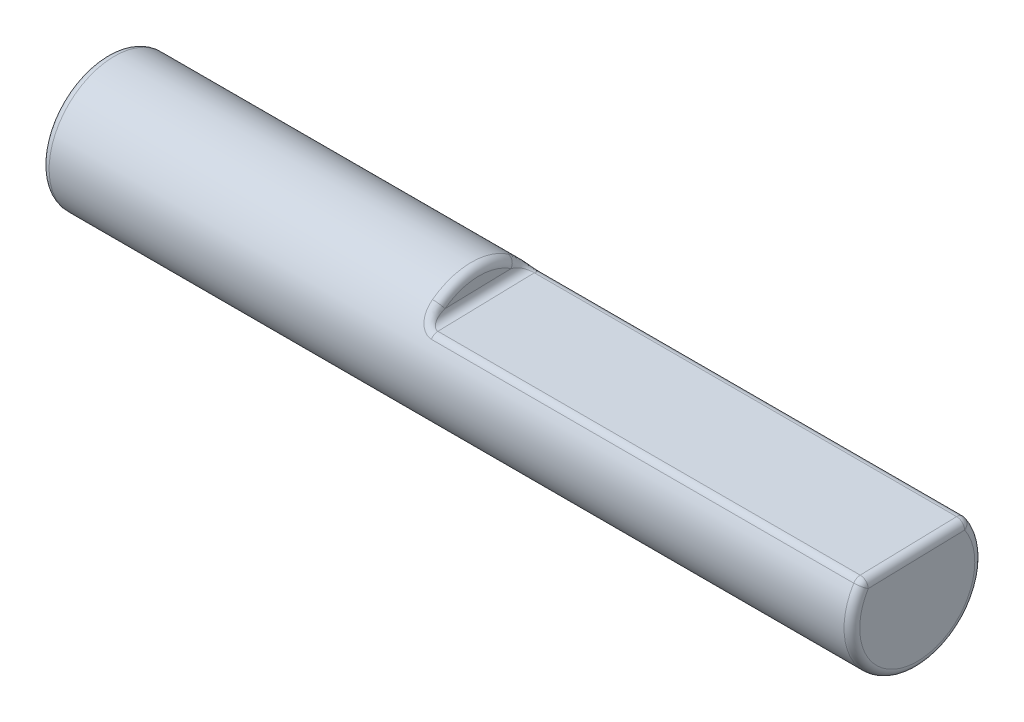
ISO-10303-21;
HEADER;
FILE_DESCRIPTION(('STEP AP214'),'2;1');
FILE_NAME('part.step','',(''),(''),'','','');
FILE_SCHEMA(('AUTOMOTIVE_DESIGN { 1 0 10303 214 1 1 1 1 }'));
ENDSEC;
DATA;
#1=APPLICATION_CONTEXT('core data for automotive mechanical design processes');
#2=APPLICATION_PROTOCOL_DEFINITION('international standard','automotive_design',2000,#1);
#3=PRODUCT_CONTEXT('',#1,'mechanical');
#4=PRODUCT('Part','Part','',(#3));
#5=PRODUCT_RELATED_PRODUCT_CATEGORY('part','',(#4));
#6=PRODUCT_DEFINITION_FORMATION('','',#4);
#7=PRODUCT_DEFINITION_CONTEXT('part definition',#1,'design');
#8=PRODUCT_DEFINITION('design','',#6,#7);
#9=PRODUCT_DEFINITION_SHAPE('','',#8);
#10=(LENGTH_UNIT() NAMED_UNIT(*) SI_UNIT(.MILLI.,.METRE.));
#11=(NAMED_UNIT(*) PLANE_ANGLE_UNIT() SI_UNIT($,.RADIAN.));
#12=(NAMED_UNIT(*) SI_UNIT($,.STERADIAN.) SOLID_ANGLE_UNIT());
#13=UNCERTAINTY_MEASURE_WITH_UNIT(LENGTH_MEASURE(1.E-05),#10,'distance_accuracy_value','');
#14=(GEOMETRIC_REPRESENTATION_CONTEXT(3) GLOBAL_UNCERTAINTY_ASSIGNED_CONTEXT((#13)) GLOBAL_UNIT_ASSIGNED_CONTEXT((#10,
#11,#12)) REPRESENTATION_CONTEXT('',''));
#15=CARTESIAN_POINT('',(0.,0.,0.));
#16=DIRECTION('',(0.,0.,1.));
#17=DIRECTION('',(1.,0.,0.));
#18=AXIS2_PLACEMENT_3D('',#15,#16,#17);
#19=CARTESIAN_POINT('',(39.37,0.,0.));
#20=DIRECTION('',(-1.,0.,0.));
#21=DIRECTION('',(0.,0.,1.));
#22=AXIS2_PLACEMENT_3D('',#19,#20,#21);
#23=CYLINDRICAL_SURFACE('',#22,3.175);
#24=CARTESIAN_POINT('',(0.380999999999999,0.,0.));
#25=DIRECTION('',(1.,0.,0.));
#26=DIRECTION('',(0.,0.,-1.));
#27=AXIS2_PLACEMENT_3D('',#24,#25,#26);
#28=CIRCLE('',#27,3.175);
#29=CARTESIAN_POINT('',(0.380999999999999,0.,-3.175));
#30=VERTEX_POINT('',#29);
#31=EDGE_CURVE('E297',#30,#30,#28,.T.);
#32=ORIENTED_EDGE('',*,*,#31,.T.);
#33=EDGE_LOOP('',(#32));
#34=FACE_BOUND('',#33,.T.);
#35=CARTESIAN_POINT('',(18.5864113464813,1.86061677622849,2.36945052063749));
#36=CARTESIAN_POINT('',(18.6239620396878,1.8664609920511,2.57606934951021));
#37=CARTESIAN_POINT('',(18.6943226929627,1.69924548178732,2.68201226556207));
#38=CARTESIAN_POINT('',(18.5691276856336,1.85531270441578,2.37616676666429));
#39=CARTESIAN_POINT('',(18.600875282423,1.85749105612046,2.58277024156461));
#40=CARTESIAN_POINT('',(18.6597553712666,1.68738842412367,2.68949626337339));
#41=CARTESIAN_POINT('',(18.5513109242381,1.85128223441124,2.38121692365727));
#42=CARTESIAN_POINT('',(18.5768882237581,1.85068500253967,2.58781753681003));
#43=CARTESIAN_POINT('',(18.6241218484758,1.67837691595813,2.69512250049785));
#44=CARTESIAN_POINT('',(18.5151628451154,1.84587687221378,2.38795387459997));
#45=CARTESIAN_POINT('',(18.5281157818434,1.84157359403442,2.59454953766819));
#46=CARTESIAN_POINT('',(18.551825690231,1.66629032446794,2.70262711959848));
#47=CARTESIAN_POINT('',(18.4968321068419,1.84449910257518,2.38964431297881));
#48=CARTESIAN_POINT('',(18.5033012442463,1.83925197265389,2.59624634845099));
#49=CARTESIAN_POINT('',(18.5151642136843,1.66320880874467,2.70450956262816));
#50=CARTESIAN_POINT('',(18.4599786529568,1.84449552930852,2.38964534121022));
#51=CARTESIAN_POINT('',(18.4534427111945,1.83924541956583,2.59624879138466));
#52=CARTESIAN_POINT('',(18.441457305913,1.66320071994776,2.70451062871122));
#53=CARTESIAN_POINT('',(18.4414559089441,1.84589828072248,2.3879208611442));
#54=CARTESIAN_POINT('',(18.4283680865988,1.84160861468443,2.59451922324205));
#55=CARTESIAN_POINT('',(18.4044118178863,1.66633801200165,2.70259019769311));
#56=CARTESIAN_POINT('',(18.4049745013587,1.85142600111972,2.38104446763984));
#57=CARTESIAN_POINT('',(18.3791486169153,1.85092869396238,2.58764220598247));
#58=CARTESIAN_POINT('',(18.3314490027194,1.67869857779526,2.69493054907568));
#59=CARTESIAN_POINT('',(18.3870156565798,1.8555500860408,2.37589366728384));
#60=CARTESIAN_POINT('',(18.3549728002052,1.85789594340085,2.5824870818938));
#61=CARTESIAN_POINT('',(18.2955313131668,1.68791987506304,2.68919257165323));
#62=CARTESIAN_POINT('',(18.3522078075911,1.86628287038285,2.36224541373698));
#63=CARTESIAN_POINT('',(18.3084290954819,1.87606450098342,2.56887370326151));
#64=CARTESIAN_POINT('',(18.225915615175,1.71191094840253,2.67398282988706));
#65=CARTESIAN_POINT('',(18.3353561737102,1.87288541272295,2.35375625136794));
#66=CARTESIAN_POINT('',(18.2860283498056,1.8872793953742,2.56040524868403));
#67=CARTESIAN_POINT('',(18.1922123473936,1.72666697481243,2.66452031537807));
#68=CARTESIAN_POINT('',(18.3031058699795,1.88824233783816,2.33353659065094));
#69=CARTESIAN_POINT('',(18.2436400200386,1.91343730516876,2.54031499979632));
#70=CARTESIAN_POINT('',(18.1277117399579,1.76097448524634,2.641971655952));
#71=CARTESIAN_POINT('',(18.2877095857453,1.89700017172521,2.32180089007985));
#72=CARTESIAN_POINT('',(18.2236330136026,1.92842247979147,2.52865914842707));
#73=CARTESIAN_POINT('',(18.0969191715348,1.78053366009441,2.62887969517106));
#74=CARTESIAN_POINT('',(18.2582241196294,1.91655090994752,2.29484670019643));
#75=CARTESIAN_POINT('',(18.1860031415294,1.96198733713377,2.50200106090461));
#76=CARTESIAN_POINT('',(18.037948239213,1.82417519910743,2.59879421738565));
#77=CARTESIAN_POINT('',(18.2441938216674,1.92740079294856,2.27952725029035));
#78=CARTESIAN_POINT('',(18.1684667890501,1.98071569139524,2.48686134279981));
#79=CARTESIAN_POINT('',(18.0098876431477,1.84838410573956,2.58168754224174));
#80=CARTESIAN_POINT('',(18.21819636433,1.95044233090003,2.24590286258762));
#81=CARTESIAN_POINT('',(18.1369282094077,2.02063141439924,2.45378195785048));
#82=CARTESIAN_POINT('',(17.957892728466,1.89976428689574,2.54411811476548));
#83=CARTESIAN_POINT('',(18.20623157848,1.96263550345286,2.22759453657761));
#84=CARTESIAN_POINT('',(18.1229278039632,2.04188053771935,2.43578407032227));
#85=CARTESIAN_POINT('',(17.9339631569006,1.92693891165497,2.52365155349101));
#86=CARTESIAN_POINT('',(18.1802938803284,1.99264886394887,2.18088857820481));
#87=CARTESIAN_POINT('',(18.0939779101287,2.09447536878849,2.38998506591887));
#88=CARTESIAN_POINT('',(17.8820877607386,1.99378163171355,2.47140825448484));
#89=CARTESIAN_POINT('',(18.1672674359335,2.01085591234254,2.15129100670114));
#90=CARTESIAN_POINT('',(18.0807722093846,2.12660683697858,2.36102216723603));
#91=CARTESIAN_POINT('',(17.8560348718877,2.03429405335517,2.43827823086114));
#92=CARTESIAN_POINT('',(18.1449914781523,2.04782943375368,2.08793927786675));
#93=CARTESIAN_POINT('',(18.061155442702,2.19215653699959,2.29941171032207));
#94=CARTESIAN_POINT('',(17.8114829562839,2.11646998902106,2.36730788375926));
#95=CARTESIAN_POINT('',(18.1357463028738,2.06659652295876,2.05418040386822));
#96=CARTESIAN_POINT('',(18.0548419075053,2.22571762123843,2.26658152208577));
#97=CARTESIAN_POINT('',(17.7929926057465,2.1581347669446,2.32946221475157));
#98=CARTESIAN_POINT('',(18.1175767324406,2.11127559581752,1.96934888447875));
#99=CARTESIAN_POINT('',(18.0470916814408,2.30634325466988,2.18416014327292));
#100=CARTESIAN_POINT('',(17.7566534648827,2.25719798063517,2.23428957702657));
#101=CARTESIAN_POINT('',(18.1102131041597,2.13709014841927,1.91669422351018));
#102=CARTESIAN_POINT('',(18.0489088708258,2.3532876102863,2.13313926749371));
#103=CARTESIAN_POINT('',(17.7419262082862,2.31432941245921,2.17516089294884));
#104=CARTESIAN_POINT('',(18.1004629166156,2.18716484872636,1.8064000485531));
#105=CARTESIAN_POINT('',(18.0624453938521,2.4450308250721,2.0269072916934));
#106=CARTESIAN_POINT('',(17.7224258332648,2.42491686404692,2.05119042107964));
#107=CARTESIAN_POINT('',(18.0981063710277,2.21141478255827,1.7487326188638));
#108=CARTESIAN_POINT('',(18.0746512057677,2.4899364477066,1.97126510354333));
#109=CARTESIAN_POINT('',(17.7177127421912,2.47834887258038,1.98631659577111));
#110=CARTESIAN_POINT('',(18.0971997300512,2.25308918931056,1.64154501717416));
#111=CARTESIAN_POINT('',(18.1038065780548,2.5675813512571,1.86856339253274));
#112=CARTESIAN_POINT('',(17.7158994599932,2.56994052925046,1.86563624935163));
#113=CARTESIAN_POINT('',(18.0979940123679,2.27091978608572,1.59264377162258));
#114=CARTESIAN_POINT('',(18.1197093303457,2.60124831444892,1.82140194567038));
#115=CARTESIAN_POINT('',(17.7174880243634,2.60904074450167,1.8105452240383));
#116=CARTESIAN_POINT('',(18.1013892506501,2.3049894412546,1.49291444033796));
#117=CARTESIAN_POINT('',(18.1560085124755,2.66631382468721,1.72508979460888));
#118=CARTESIAN_POINT('',(17.7242785009295,2.68356961941778,1.69812625423316));
#119=CARTESIAN_POINT('',(18.1039925353414,2.32122641740139,1.44208395091788));
#120=CARTESIAN_POINT('',(18.1766200444994,2.69765457973562,1.67579499349747));
#121=CARTESIAN_POINT('',(17.7294850705777,2.718993478883,1.64079551644434));
#122=CARTESIAN_POINT('',(18.1104252595926,2.35173838787002,1.33979125008395));
#123=CARTESIAN_POINT('',(18.2211828364737,2.75740753118695,1.57615280226641));
#124=CARTESIAN_POINT('',(17.7423505192883,2.78536536104795,1.52535910882586));
#125=CARTESIAN_POINT('',(18.1142316771751,2.36604354938308,1.28835707996336));
#126=CARTESIAN_POINT('',(18.2452540223914,2.78579308492647,1.52569960894812));
#127=CARTESIAN_POINT('',(17.7499633544017,2.81638273242603,1.46728619497699));
#128=CARTESIAN_POINT('',(18.1226335397235,2.3929742143745,1.18429308388464));
#129=CARTESIAN_POINT('',(18.2963637336602,2.84029317299343,1.42251192748725));
#130=CARTESIAN_POINT('',(17.7667670793957,2.8745668069564,1.34973233304563));
#131=CARTESIAN_POINT('',(18.1272267183352,2.40560436247825,1.1316670589229));
#132=CARTESIAN_POINT('',(18.3235182991249,2.86629149250078,1.36970693172968));
#133=CARTESIAN_POINT('',(17.7759534365679,2.90174417233004,1.29025584106037));
#134=CARTESIAN_POINT('',(18.1320010351724,2.41740942277435,1.07845527244792));
#135=CARTESIAN_POINT('',(18.351042503335,2.89057483799125,1.31683559197641));
#136=CARTESIAN_POINT('',(17.7855020703449,2.92703004363375,1.2300894779102));
#137=(BOUNDED_SURFACE() B_SPLINE_SURFACE(3,2,((#35,#36,#37),(#38,#39,#40),(#41,#42,#43),(#44,
#45,#46),(#47,#48,#49),(#50,#51,#52),(#53,#54,#55),(#56,#57,#58),(#59,#60,#61),(#62,#63,#64),
(#65,#66,#67),(#68,#69,#70),(#71,#72,#73),(#74,#75,#76),(#77,#78,#79),(#80,#81,#82),(#83,#84,
#85),(#86,#87,#88),(#89,#90,#91),(#92,#93,#94),(#95,#96,#97),(#98,#99,#100),(#101,#102,#103),
(#104,#105,#106),(#107,#108,#109),(#110,#111,#112),(#113,#114,#115),(#116,#117,#118),(#119,#120,
#121),(#122,#123,#124),(#125,#126,#127),(#128,#129,#130),(#131,#132,#133),(#134,#135,#136)),
.UNSPECIFIED.,.F.,.F.,.F.) B_SPLINE_SURFACE_WITH_KNOTS((4,2,2,2,2,2,2,2,2,2,2,2,2,2,2,2,4),(3,
3),(0.,0.109979605014105,0.21983984523759,0.330834159910746,0.441792434311733,0.552476866686735,
0.663339696503121,0.777812327617676,0.89241563857201,1.05027319729736,1.2083113554563,
1.42859982924447,1.65020508343153,1.82836901100805,2.00676271461983,2.18193077376074,
2.35660247596006),(0.,1.),
.UNSPECIFIED.) GEOMETRIC_REPRESENTATION_ITEM() RATIONAL_B_SPLINE_SURFACE(((1.,0.875696525181188,
1.),(1.,0.876819204022842,1.),(1.,0.877647414738648,1.),(1.,0.878741401126171,1.),(1.,
0.87900778625312,1.),(1.,0.879006937081256,1.),(1.,0.878734165904822,1.),(1.,0.877621403045872,
1.),(1.,0.876781595570752,1.),(1.,0.874483221090066,1.),(1.,0.873026186281496,1.),(1.,
0.869421553804353,1.),(1.,0.867272846894885,1.),(1.,0.862141294560381,1.),(1.,0.859133566871117,
1.),(1.,0.852278123703959,1.),(1.,0.848429453231229,1.),(1.,0.838277208471232,1.),(1.,
0.831595334164918,1.),(1.,0.816756892948542,1.),(1.,0.808598647638927,1.),(1.,0.78754094815492,
1.),(1.,0.774039732630419,1.),(1.,0.745150665958186,1.),(1.,0.729752019803924,1.),(1.,
0.700926713202265,1.),(1.,0.68770522078148,1.),(1.,0.660816578297561,1.),(1.,0.647148875465999,
1.),(1.,0.619959656878177,1.),(1.,0.606439966404383,1.),(1.,0.579679073015142,1.),(1.,
0.566437189530011,1.),(1.,0.553482817324471,1.))) REPRESENTATION_ITEM('') SURFACE());
#138=CARTESIAN_POINT('',(17.7855020703449,2.92703004363375,1.2300894779102));
#139=CARTESIAN_POINT('',(17.7759534365679,2.90174417233004,1.29025584106037));
#140=CARTESIAN_POINT('',(17.7667670793957,2.8745668069564,1.34973233304563));
#141=CARTESIAN_POINT('',(17.7499633544017,2.81638273242603,1.46728619497699));
#142=CARTESIAN_POINT('',(17.7423505192883,2.78536536104795,1.52535910882586));
#143=CARTESIAN_POINT('',(17.7294850705777,2.718993478883,1.64079551644434));
#144=CARTESIAN_POINT('',(17.7242785009295,2.68356961941778,1.69812625423316));
#145=CARTESIAN_POINT('',(17.7174880243634,2.60904074450167,1.8105452240383));
#146=CARTESIAN_POINT('',(17.7158994599932,2.56994052925046,1.86563624935163));
#147=CARTESIAN_POINT('',(17.7177127421912,2.47834887258038,1.98631659577111));
#148=CARTESIAN_POINT('',(17.7224258332648,2.42491686404692,2.05119042107964));
#149=CARTESIAN_POINT('',(17.7419262082862,2.31432941245921,2.17516089294884));
#150=CARTESIAN_POINT('',(17.7566534648827,2.25719798063517,2.23428957702657));
#151=CARTESIAN_POINT('',(17.7929926057465,2.1581347669446,2.32946221475157));
#152=CARTESIAN_POINT('',(17.8114829562839,2.11646998902107,2.36730788375926));
#153=CARTESIAN_POINT('',(17.8560348718877,2.03429405335517,2.43827823086114));
#154=CARTESIAN_POINT('',(17.8820877607386,1.99378163171355,2.47140825448484));
#155=CARTESIAN_POINT('',(17.9339631569006,1.92693891165497,2.52365155349101));
#156=CARTESIAN_POINT('',(17.957892728466,1.89976428689574,2.54411811476548));
#157=CARTESIAN_POINT('',(18.0098876431477,1.84838410573956,2.58168754224174));
#158=CARTESIAN_POINT('',(18.037948239213,1.82417519910743,2.59879421738565));
#159=CARTESIAN_POINT('',(18.0969191715348,1.78053366009441,2.62887969517106));
#160=CARTESIAN_POINT('',(18.1277117399579,1.76097448524634,2.641971655952));
#161=CARTESIAN_POINT('',(18.1922123473936,1.72666697481243,2.66452031537807));
#162=CARTESIAN_POINT('',(18.225915615175,1.71191094840253,2.67398282988706));
#163=CARTESIAN_POINT('',(18.2955313131668,1.68791987506304,2.68919257165323));
#164=CARTESIAN_POINT('',(18.3314490027194,1.67869857779526,2.69493054907568));
#165=CARTESIAN_POINT('',(18.4044118178863,1.66633801200165,2.70259019769311));
#166=CARTESIAN_POINT('',(18.441457305913,1.66320071994777,2.70451062871122));
#167=CARTESIAN_POINT('',(18.5151642136843,1.66320880874467,2.70450956262816));
#168=CARTESIAN_POINT('',(18.551825690231,1.66629032446794,2.70262711959848));
#169=CARTESIAN_POINT('',(18.6241218484758,1.67837691595813,2.69512250049785));
#170=CARTESIAN_POINT('',(18.6597553712666,1.68738842412367,2.68949626337339));
#171=CARTESIAN_POINT('',(18.6943226929627,1.69924548178732,2.68201226556207));
#172=B_SPLINE_CURVE_WITH_KNOTS('',3,(#138,#139,#140,#141,#142,#143,#144,#145,#146,#147,#148,
#149,#150,#151,#152,#153,#154,#155,#156,#157,#158,#159,#160,#161,#162,#163,#164,#165,#166,#167,
#168,#169,#170,#171),.UNSPECIFIED.,.F.,.F.,(4,2,2,2,2,2,2,2,2,2,2,2,2,2,2,2,4),(0.,
0.174671702199316,0.349839761340227,0.528233464952004,0.706397392528527,0.92800264671559,
1.14829112050375,1.3063292786627,1.46418683738804,1.57879014834238,1.69326277945693,
1.80412560927332,1.91481004164832,2.02576831604931,2.13676263072247,2.24662287094595,
2.35660247596006),.UNSPECIFIED.);
#173=CARTESIAN_POINT('',(17.7165,2.55004648338834,1.89153057933484));
#174=VERTEX_POINT('',#173);
#175=CARTESIAN_POINT('',(18.4785,1.66320478511395,2.70451009293255));
#176=VERTEX_POINT('',#175);
#177=EDGE_CURVE('E290',#174,#176,#172,.T.);
#178=ORIENTED_EDGE('',*,*,#177,.F.);
#179=CARTESIAN_POINT('',(17.7165,0.,0.));
#180=DIRECTION('',(-1.,0.,0.));
#181=DIRECTION('',(0.,0.,1.));
#182=AXIS2_PLACEMENT_3D('',#179,#180,#181);
#183=CIRCLE('',#182,3.175);
#184=CARTESIAN_POINT('',(17.7165,2.64280139391695,-1.75960955677975));
#185=VERTEX_POINT('',#184);
#186=EDGE_CURVE('E109',#174,#185,#183,.T.);
#187=ORIENTED_EDGE('',*,*,#186,.T.);
#188=CARTESIAN_POINT('',(18.1341905023827,2.47313278792479,-0.929790084784355));
#189=CARTESIAN_POINT('',(18.3639734733044,2.96369122443615,-1.14301851228131));
#190=CARTESIAN_POINT('',(17.7898810047653,2.99569537312775,-1.05187177518031));
#191=CARTESIAN_POINT('',(18.1294019684397,2.46437474302006,-0.983264972040821));
#192=CARTESIAN_POINT('',(18.3363431863217,2.94265705359688,-1.19707037018806));
#193=CARTESIAN_POINT('',(17.7803039368059,2.9742543950184,-1.11293055452863));
#194=CARTESIAN_POINT('',(18.1247624690788,2.45477757696794,-1.03621001373454));
#195=CARTESIAN_POINT('',(18.3090031225493,2.91994457885805,-1.25108863702687));
#196=CARTESIAN_POINT('',(17.7710249381208,2.95092222441763,-1.17341105694561));
#197=CARTESIAN_POINT('',(18.1161892705911,2.43388562169779,-1.14102346267586));
#198=CARTESIAN_POINT('',(18.2573467979093,2.87193959302793,-1.35678020802059));
#199=CARTESIAN_POINT('',(17.7538785412191,2.90043195384652,-1.29319680086037));
#200=CARTESIAN_POINT('',(18.1122573756501,2.42258662422196,-1.19288882775468));
#201=CARTESIAN_POINT('',(18.2329262066967,2.84677023994148,-1.40851008729006));
#202=CARTESIAN_POINT('',(17.7460147513741,2.87326438050473,-1.35249870452667));
#203=CARTESIAN_POINT('',(18.1054566034908,2.39803114103891,-1.29645583950263));
#204=CARTESIAN_POINT('',(18.1873623196213,2.79330806338998,-1.51110560413029));
#205=CARTESIAN_POINT('',(17.7324132069055,2.8144865549075,-1.47097282171677));
#206=CARTESIAN_POINT('',(18.1026148175835,2.38473496399274,-1.34812512319508));
#207=CARTESIAN_POINT('',(18.1661188962066,2.76503432555879,-1.56206901829057));
#208=CARTESIAN_POINT('',(17.7267296348989,2.78278705782587,-1.53010938050571));
#209=CARTESIAN_POINT('',(18.0986384346416,2.35644960446841,-1.44969228552826));
#210=CARTESIAN_POINT('',(18.1283901831387,2.70598038527811,-1.66187338182173));
#211=CARTESIAN_POINT('',(17.7187768690133,2.71559266983258,-1.64641708269041));
#212=CARTESIAN_POINT('',(18.0975019744406,2.34146228894075,-1.49959203917676));
#213=CARTESIAN_POINT('',(18.1116969196926,2.67527084306931,-1.71084799126658));
#214=CARTESIAN_POINT('',(17.7165039488013,2.68010196652802,-1.70359030428956));
#215=CARTESIAN_POINT('',(18.0974972238099,2.30345354349339,-1.61716285052348));
#216=CARTESIAN_POINT('',(18.0783943816749,2.59910537279674,-1.82523082391367));
#217=CARTESIAN_POINT('',(17.7164944477321,2.59035439555285,-1.83837622007862));
#218=CARTESIAN_POINT('',(18.0997373446047,2.27964097768128,-1.68382232215996));
#219=CARTESIAN_POINT('',(18.063710276487,2.55198508508872,-1.8908185457887));
#220=CARTESIAN_POINT('',(17.7209746892161,2.53432925583875,-1.91486146749265));
#221=CARTESIAN_POINT('',(18.1105834683634,2.2297090887604,-1.81076112732047));
#222=CARTESIAN_POINT('',(18.0482213830287,2.45497751815753,-2.01558647679361));
#223=CARTESIAN_POINT('',(17.7426669367202,2.4172221038779,-2.06064367928652));
#224=CARTESIAN_POINT('',(18.119131788089,2.20361254448583,-1.87109265147976));
#225=CARTESIAN_POINT('',(18.0466923300968,2.40498959580597,-2.07538897589359));
#226=CARTESIAN_POINT('',(17.7597635762618,2.35619033931357,-2.12999933228784));
#227=CARTESIAN_POINT('',(18.139431751241,2.16135772100504,-1.96069216875758));
#228=CARTESIAN_POINT('',(18.0572988918809,2.32503752005264,-2.1646831757065));
#229=CARTESIAN_POINT('',(17.8003635024318,2.25760267407526,-2.2331016851402));
#230=CARTESIAN_POINT('',(18.1485161119943,2.14541948765644,-1.99270116650551));
#231=CARTESIAN_POINT('',(18.0640067335089,2.29530187505624,-2.19654788923173));
#232=CARTESIAN_POINT('',(17.8185322238258,2.22046763862043,-2.2699588237116));
#233=CARTESIAN_POINT('',(18.1700439006968,2.11390174586578,-2.05301756447317));
#234=CARTESIAN_POINT('',(18.0835729430861,2.23711937049072,-2.25663718827951));
#235=CARTESIAN_POINT('',(17.8615878013179,2.14711938041226,-2.33945367830609));
#236=CARTESIAN_POINT('',(18.1824895631031,2.09832248355702,-2.08132248372334));
#237=CARTESIAN_POINT('',(18.0963658365802,2.20856141987183,-2.2850125711189));
#238=CARTESIAN_POINT('',(17.8864791263305,2.1109067884488,-2.37208856612658));
#239=CARTESIAN_POINT('',(18.211067248488,2.06823964868463,-2.13365896718705));
#240=CARTESIAN_POINT('',(18.1283512970163,2.15398855389044,-2.33751986989063));
#241=CARTESIAN_POINT('',(17.9436344968504,2.04104884994489,-2.43246808970737));
#242=CARTESIAN_POINT('',(18.2272340159478,2.05374803932415,-2.15764619565517));
#243=CARTESIAN_POINT('',(18.1475787265335,2.12786952256222,-2.36175791806184));
#244=CARTESIAN_POINT('',(17.975968031314,2.0074319628021,-2.46016196629496));
#245=CARTESIAN_POINT('',(18.2630460143898,2.02707924621252,-2.2002174723069));
#246=CARTESIAN_POINT('',(18.1919279737883,2.0802717739033,-2.4047987145019));
#247=CARTESIAN_POINT('',(18.0475920281882,1.94561243483343,-2.50933901244599));
#248=CARTESIAN_POINT('',(18.2826874844034,2.01489958929147,-2.21880730566401));
#249=CARTESIAN_POINT('',(18.2170598483639,2.05866695165713,-2.42372852510654));
#250=CARTESIAN_POINT('',(18.0868749686603,1.91740400807438,-2.53082883165927));
#251=CARTESIAN_POINT('',(18.3217849184163,1.99544826213891,-2.24772736525183));
#252=CARTESIAN_POINT('',(18.2680605778029,2.02442613620939,-2.45319434086187));
#253=CARTESIAN_POINT('',(18.1650698369576,1.87237635998464,-2.56427490238752));
#254=CARTESIAN_POINT('',(18.3408501238559,1.98771985118057,-2.25886680651986));
#255=CARTESIAN_POINT('',(18.2933022438088,2.01089078633314,-2.46459856468082));
#256=CARTESIAN_POINT('',(18.203200247744,1.85449608074485,-2.57716448670486));
#257=CARTESIAN_POINT('',(18.380487248131,1.97527835310497,-2.27655087496051));
#258=CARTESIAN_POINT('',(18.3461832725315,1.98920693919082,-2.48269898626542));
#259=CARTESIAN_POINT('',(18.2824744962274,1.82571888208066,-2.59763191682843));
#260=CARTESIAN_POINT('',(18.4010575481574,1.97056207790239,-2.2831003609211));
#261=CARTESIAN_POINT('',(18.3738622895416,1.98101447009375,-2.48943280879809));
#262=CARTESIAN_POINT('',(18.3236150963061,1.81481457916767,-2.60521537952105));
#263=CARTESIAN_POINT('',(18.4403554608013,1.96486509340047,-2.29097794114208));
#264=CARTESIAN_POINT('',(18.4268797388771,1.97114341042692,-2.49752366762618));
#265=CARTESIAN_POINT('',(18.4022109216102,1.80164379466081,-2.6143373069388));
#266=CARTESIAN_POINT('',(18.4589979032268,1.96349577240607,-2.29284986576948));
#267=CARTESIAN_POINT('',(18.4521156768301,1.96877450701537,-2.49945091695443));
#268=CARTESIAN_POINT('',(18.4394958064556,1.79847870003612,-2.61650537079105));
#269=CARTESIAN_POINT('',(18.496300323664,1.96341522144709,-2.29296003419046));
#270=CARTESIAN_POINT('',(18.5025815462412,1.9686350523109,-2.49956438992405));
#271=CARTESIAN_POINT('',(18.5141006473259,1.79829251030992,-2.61663296676295));
#272=CARTESIAN_POINT('',(18.5149603047177,1.9647046013986,-2.29119744421257));
#273=CARTESIAN_POINT('',(18.5278432902503,1.9708653804644,-2.49774989809651));
#274=CARTESIAN_POINT('',(18.5514206094347,1.80127282498867,-2.61459153320788));
#275=CARTESIAN_POINT('',(18.5510558495348,1.96978030577213,-2.28418358195071));
#276=CARTESIAN_POINT('',(18.5765431839511,1.97965862877354,-2.49054565618816));
#277=CARTESIAN_POINT('',(18.6236116990702,1.81300714649384,-2.60646966065092));
#278=CARTESIAN_POINT('',(18.5685113390765,1.97347575155864,-2.27905923384329));
#279=CARTESIAN_POINT('',(18.600043873737,1.98607456474883,-2.48527719823452));
#280=CARTESIAN_POINT('',(18.6585226781532,1.82155101581374,-2.60053616854032));
#281=CARTESIAN_POINT('',(18.6024460682606,1.98305049522653,-2.26552764164808));
#282=CARTESIAN_POINT('',(18.645441942535,2.00273634474729,-2.47142162312479));
#283=CARTESIAN_POINT('',(18.7263921365209,1.8436951655787,-2.58487321052664));
#284=CARTESIAN_POINT('',(18.6189252853435,1.98892984355043,-2.25712032173187));
#285=CARTESIAN_POINT('',(18.6673657559731,2.01300308331627,-2.46281679159412));
#286=CARTESIAN_POINT('',(18.7593505706864,1.85729556281653,-2.57514365694405));
#287=CARTESIAN_POINT('',(18.6346917565338,1.99578921052919,-2.24711140873195));
#288=CARTESIAN_POINT('',(18.6880745844236,2.0250108878266,-2.45261527789264));
#289=CARTESIAN_POINT('',(18.7908835130676,1.87316876284834,-2.56356466387903));
#290=(BOUNDED_SURFACE() B_SPLINE_SURFACE(3,2,((#188,#189,#190),(#191,#192,#193),(#194,#195,
#196),(#197,#198,#199),(#200,#201,#202),(#203,#204,#205),(#206,#207,#208),(#209,#210,#211),
(#212,#213,#214),(#215,#216,#217),(#218,#219,#220),(#221,#222,#223),(#224,#225,#226),(#227,#228,
#229),(#230,#231,#232),(#233,#234,#235),(#236,#237,#238),(#239,#240,#241),(#242,#243,#244),
(#245,#246,#247),(#248,#249,#250),(#251,#252,#253),(#254,#255,#256),(#257,#258,#259),(#260,#261,
#262),(#263,#264,#265),(#266,#267,#268),(#269,#270,#271),(#272,#273,#274),(#275,#276,#277),
(#278,#279,#280),(#281,#282,#283),(#284,#285,#286),(#287,#288,#289)),.UNSPECIFIED.,.F.,.F.,
.F.) B_SPLINE_SURFACE_WITH_KNOTS((4,2,2,2,2,2,2,2,2,2,2,2,2,2,2,2,4),(3,3),(0.,
0.173248836944608,0.346933335867549,0.524690929361414,0.702254170706211,0.951919480819184,
1.19932966387977,1.34732751797523,1.49542399824134,1.64496379912426,1.79434271967722,
1.92193480842236,2.04939162718751,2.16114701727453,2.27292804732529,2.38071441823939,
2.48850327889578),(0.,1.),
.UNSPECIFIED.) GEOMETRIC_REPRESENTATION_ITEM() RATIONAL_B_SPLINE_SURFACE(((1.,0.547606480192875,
1.),(1.,0.560359682932013,1.),(1.,0.573424936455794,1.),(1.,0.599879323130062,1.),(1.,
0.613269188109452,1.),(1.,0.640318570500403,1.),(1.,0.653977047742926,1.),(1.,0.680906548091395,
1.),(1.,0.694177978494562,1.),(1.,0.725285507307096,1.),(1.,0.742786852814231,1.),(1.,
0.775341861423871,1.),(1.,0.790416205566558,1.),(1.,0.811926405637072,1.),(1.,0.819399514188753,
1.),(1.,0.833048896557436,1.),(1.,0.839224302841507,1.),(1.,0.850224407389942,1.),(1.,
0.855035355360919,1.),(1.,0.863232833570831,1.),(1.,0.866620890681609,1.),(1.,0.871698951997393,
1.),(1.,0.873564545316049,1.),(1.,0.876457776981406,1.),(1.,0.877486301610389,1.),(1.,
0.878713480114761,1.),(1.,0.878998757213615,1.),(1.,0.879015583797091,1.),(1.,0.878747006225344,
1.),(1.,0.877655652456154,1.),(1.,0.876853024358936,1.),(1.,0.874661101921426,1.),(1.,
0.873271794030241,1.),(1.,0.871562708712587,1.))) REPRESENTATION_ITEM('') SURFACE());
#291=CARTESIAN_POINT('',(18.7908835130676,1.87316876284834,-2.56356466387903));
#292=CARTESIAN_POINT('',(18.7593505706864,1.85729556281653,-2.57514365694405));
#293=CARTESIAN_POINT('',(18.7263921365209,1.8436951655787,-2.58487321052664));
#294=CARTESIAN_POINT('',(18.6585226781532,1.82155101581374,-2.60053616854032));
#295=CARTESIAN_POINT('',(18.6236116990702,1.81300714649384,-2.60646966065092));
#296=CARTESIAN_POINT('',(18.5514206094347,1.80127282498867,-2.61459153320788));
#297=CARTESIAN_POINT('',(18.5141006473259,1.79829251030992,-2.61663296676295));
#298=CARTESIAN_POINT('',(18.4394958064556,1.79847870003612,-2.61650537079105));
#299=CARTESIAN_POINT('',(18.4022109216102,1.80164379466081,-2.6143373069388));
#300=CARTESIAN_POINT('',(18.3236150963061,1.81481457916767,-2.60521537952105));
#301=CARTESIAN_POINT('',(18.2824744962274,1.82571888208066,-2.59763191682843));
#302=CARTESIAN_POINT('',(18.203200247744,1.85449608074484,-2.57716448670486));
#303=CARTESIAN_POINT('',(18.1650698369576,1.87237635998464,-2.56427490238752));
#304=CARTESIAN_POINT('',(18.0868749686603,1.91740400807438,-2.53082883165927));
#305=CARTESIAN_POINT('',(18.0475920281882,1.94561243483343,-2.50933901244599));
#306=CARTESIAN_POINT('',(17.975968031314,2.0074319628021,-2.46016196629496));
#307=CARTESIAN_POINT('',(17.9436344968504,2.04104884994489,-2.43246808970737));
#308=CARTESIAN_POINT('',(17.8864791263305,2.1109067884488,-2.37208856612658));
#309=CARTESIAN_POINT('',(17.8615878013179,2.14711938041226,-2.33945367830609));
#310=CARTESIAN_POINT('',(17.8185322238258,2.22046763862043,-2.2699588237116));
#311=CARTESIAN_POINT('',(17.8003635024318,2.25760267407526,-2.2331016851402));
#312=CARTESIAN_POINT('',(17.7597635762618,2.35619033931357,-2.12999933228784));
#313=CARTESIAN_POINT('',(17.7426669367202,2.4172221038779,-2.06064367928652));
#314=CARTESIAN_POINT('',(17.7209746892161,2.53432925583875,-1.91486146749265));
#315=CARTESIAN_POINT('',(17.7164944477321,2.59035439555285,-1.83837622007862));
#316=CARTESIAN_POINT('',(17.7165039488013,2.68010196652802,-1.70359030428956));
#317=CARTESIAN_POINT('',(17.7187768690133,2.71559266983258,-1.64641708269041));
#318=CARTESIAN_POINT('',(17.7267296348989,2.78278705782587,-1.53010938050571));
#319=CARTESIAN_POINT('',(17.7324132069055,2.8144865549075,-1.47097282171677));
#320=CARTESIAN_POINT('',(17.7460147513741,2.87326438050473,-1.35249870452667));
#321=CARTESIAN_POINT('',(17.7538785412191,2.90043195384652,-1.29319680086037));
#322=CARTESIAN_POINT('',(17.7710249381208,2.95092222441763,-1.17341105694561));
#323=CARTESIAN_POINT('',(17.7803039368059,2.9742543950184,-1.11293055452863));
#324=CARTESIAN_POINT('',(17.7898810047653,2.99569537312775,-1.05187177518031));
#325=B_SPLINE_CURVE_WITH_KNOTS('',3,(#291,#292,#293,#294,#295,#296,#297,#298,#299,#300,#301,
#302,#303,#304,#305,#306,#307,#308,#309,#310,#311,#312,#313,#314,#315,#316,#317,#318,#319,#320,
#321,#322,#323,#324),.UNSPECIFIED.,.F.,.F.,(4,2,2,2,2,2,2,2,2,2,2,2,2,2,2,2,4),(0.,
0.107788860656388,0.215575231570491,0.327356261621256,0.439111651708278,0.56656847047342,
0.69416055921856,0.843539479771521,0.993079280654442,1.14117576092055,1.28917361501601,
1.5365837980766,1.78624910818957,1.96381234953437,2.14156994302823,2.31525444195118,
2.48850327889578),.UNSPECIFIED.);
#326=CARTESIAN_POINT('',(18.4785,1.79838348211942,-2.61657062798619));
#327=VERTEX_POINT('',#326);
#328=EDGE_CURVE('E148',#327,#185,#325,.T.);
#329=ORIENTED_EDGE('',*,*,#328,.F.);
#330=DIRECTION('',(-1.,0.,0.));
#331=VECTOR('',#330,1.);
#332=CARTESIAN_POINT('',(39.37,1.79838348211942,-2.61657062798619));
#333=LINE('',#332,#331);
#334=CARTESIAN_POINT('',(38.989,1.79838348211942,-2.61657062798619));
#335=VERTEX_POINT('',#334);
#336=EDGE_CURVE('E145',#327,#335,#333,.F.);
#337=ORIENTED_EDGE('',*,*,#336,.T.);
#338=CARTESIAN_POINT('',(38.989,0.,0.));
#339=DIRECTION('',(1.,0.,0.));
#340=DIRECTION('',(0.,0.,-1.));
#341=AXIS2_PLACEMENT_3D('',#338,#339,#340);
#342=CIRCLE('',#341,3.175);
#343=CARTESIAN_POINT('',(38.989,1.66320478511395,2.70451009293255));
#344=VERTEX_POINT('',#343);
#345=EDGE_CURVE('E137',#335,#344,#342,.F.);
#346=ORIENTED_EDGE('',*,*,#345,.T.);
#347=DIRECTION('',(-1.,0.,0.));
#348=VECTOR('',#347,1.);
#349=CARTESIAN_POINT('',(39.37,1.66320478511395,2.70451009293255));
#350=LINE('',#349,#348);
#351=EDGE_CURVE('E140',#344,#176,#350,.T.);
#352=ORIENTED_EDGE('',*,*,#351,.T.);
#353=EDGE_LOOP('',(#178,#187,#329,#337,#346,#352));
#354=FACE_BOUND('',#353,.T.);
#355=ADVANCED_FACE('F39',(#34,#354),#23,.T.);
#356=CARTESIAN_POINT('',(39.37,0.,0.));
#357=DIRECTION('',(1.,0.,0.));
#358=DIRECTION('',(0.,0.,-1.));
#359=AXIS2_PLACEMENT_3D('',#356,#357,#358);
#360=PLANE('',#359);
#361=CARTESIAN_POINT('',(39.37,0.,0.));
#362=DIRECTION('',(1.,0.,0.));
#363=DIRECTION('',(0.,0.,-1.));
#364=AXIS2_PLACEMENT_3D('',#361,#362,#363);
#365=CIRCLE('',#364,2.794);
#366=CARTESIAN_POINT('',(39.37,1.46362021089986,2.37996888178091));
#367=VERTEX_POINT('',#366);
#368=CARTESIAN_POINT('',(39.37,1.58257746426468,-2.30258215262812));
#369=VERTEX_POINT('',#368);
#370=EDGE_CURVE('E49',#367,#369,#365,.T.);
#371=ORIENTED_EDGE('',*,*,#370,.T.);
#372=DIRECTION('',(0.,0.0253961749971585,-0.999677465133387));
#373=VECTOR('',#372,1.);
#374=CARTESIAN_POINT('',(39.37,1.45858474981178,2.57818128885724));
#375=LINE('',#374,#373);
#376=EDGE_CURVE('E11',#369,#367,#375,.F.);
#377=ORIENTED_EDGE('',*,*,#376,.T.);
#378=EDGE_LOOP('',(#371,#377));
#379=FACE_BOUND('',#378,.T.);
#380=ADVANCED_FACE('F165',(#379),#360,.T.);
#381=CARTESIAN_POINT('',(0.,0.,0.));
#382=DIRECTION('',(1.,0.,0.));
#383=DIRECTION('',(0.,0.,-1.));
#384=AXIS2_PLACEMENT_3D('',#381,#382,#383);
#385=PLANE('',#384);
#386=CARTESIAN_POINT('',(0.,0.,0.));
#387=DIRECTION('',(1.,0.,0.));
#388=DIRECTION('',(0.,0.,-1.));
#389=AXIS2_PLACEMENT_3D('',#386,#387,#388);
#390=CIRCLE('',#389,2.794);
#391=CARTESIAN_POINT('',(0.,0.,-2.794));
#392=VERTEX_POINT('',#391);
#393=EDGE_CURVE('E301',#392,#392,#390,.F.);
#394=ORIENTED_EDGE('',*,*,#393,.T.);
#395=EDGE_LOOP('',(#394));
#396=FACE_BOUND('',#395,.T.);
#397=ADVANCED_FACE('F167',(#396),#385,.F.);
#398=CARTESIAN_POINT('',(18.0975,1.8394618640276,2.58785723153116));
#399=DIRECTION('',(0.,-0.999677465133387,-0.0253961749971585));
#400=DIRECTION('',(0.,0.0253961749971585,-0.999677465133387));
#401=AXIS2_PLACEMENT_3D('',#398,#399,#400);
#402=PLANE('',#401);
#403=DIRECTION('',(-1.,0.,0.));
#404=VECTOR('',#403,1.);
#405=CARTESIAN_POINT('',(18.0975,1.96345457848091,-2.29290620995393));
#406=LINE('',#405,#404);
#407=CARTESIAN_POINT('',(38.989,1.96345457848091,-2.29290620995393));
#408=VERTEX_POINT('',#407);
#409=CARTESIAN_POINT('',(18.4785,1.96345457848091,-2.29290620995393));
#410=VERTEX_POINT('',#409);
#411=EDGE_CURVE('E259',#408,#410,#406,.T.);
#412=ORIENTED_EDGE('',*,*,#411,.T.);
#413=DIRECTION('',(0.,0.0253961749971585,-0.999677465133387));
#414=VECTOR('',#413,1.);
#415=CARTESIAN_POINT('',(18.4785,1.8394618640276,2.58785723153116));
#416=LINE('',#415,#414);
#417=CARTESIAN_POINT('',(18.4785,1.8444973251161,2.38964482445456));
#418=VERTEX_POINT('',#417);
#419=EDGE_CURVE('E245',#410,#418,#416,.F.);
#420=ORIENTED_EDGE('',*,*,#419,.T.);
#421=DIRECTION('',(-1.,0.,0.));
#422=VECTOR('',#421,1.);
#423=CARTESIAN_POINT('',(18.0975,1.8444973251161,2.38964482445456));
#424=LINE('',#423,#422);
#425=CARTESIAN_POINT('',(38.989,1.8444973251161,2.38964482445456));
#426=VERTEX_POINT('',#425);
#427=EDGE_CURVE('E263',#418,#426,#424,.F.);
#428=ORIENTED_EDGE('',*,*,#427,.T.);
#429=DIRECTION('',(0.,0.0253961749971585,-0.999677465133387));
#430=VECTOR('',#429,1.);
#431=CARTESIAN_POINT('',(38.989,1.9684900395694,-2.49111861703052));
#432=LINE('',#431,#430);
#433=EDGE_CURVE('E236',#426,#408,#432,.T.);
#434=ORIENTED_EDGE('',*,*,#433,.T.);
#435=EDGE_LOOP('',(#412,#420,#428,#434));
#436=FACE_BOUND('',#435,.T.);
#437=ADVANCED_FACE('F230',(#436),#402,.F.);
#438=CARTESIAN_POINT('',(18.0975,0.,0.));
#439=DIRECTION('',(-1.,0.,0.));
#440=DIRECTION('',(0.,0.,1.));
#441=AXIS2_PLACEMENT_3D('',#438,#439,#440);
#442=PLANE('',#441);
#443=DIRECTION('',(0.,0.0253961749971585,-0.999677465133387));
#444=VECTOR('',#443,1.);
#445=CARTESIAN_POINT('',(18.0975,2.34936715378523,-2.4814426743566));
#446=LINE('',#445,#444);
#447=CARTESIAN_POINT('',(18.0975,2.24404090538174,1.66454690981466));
#448=VERTEX_POINT('',#447);
#449=CARTESIAN_POINT('',(18.0975,2.32566522664691,-1.54845640996618));
#450=VERTEX_POINT('',#449);
#451=EDGE_CURVE('E128',#448,#450,#446,.T.);
#452=ORIENTED_EDGE('',*,*,#451,.T.);
#453=CARTESIAN_POINT('',(18.0975,0.,0.));
#454=DIRECTION('',(-1.,0.,0.));
#455=DIRECTION('',(0.,0.,1.));
#456=AXIS2_PLACEMENT_3D('',#453,#454,#455);
#457=CIRCLE('',#456,2.794);
#458=EDGE_CURVE('E107',#450,#448,#457,.F.);
#459=ORIENTED_EDGE('',*,*,#458,.T.);
#460=EDGE_LOOP('',(#452,#459));
#461=FACE_BOUND('',#460,.T.);
#462=ADVANCED_FACE('F135',(#461),#442,.F.);
#463=CARTESIAN_POINT('',(38.989,1.45858474981178,2.57818128885724));
#464=DIRECTION('',(0.,-0.0253961749971585,0.999677465133387));
#465=DIRECTION('',(0.,-0.999677465133387,-0.0253961749971585));
#466=AXIS2_PLACEMENT_3D('',#463,#464,#465);
#467=CYLINDRICAL_SURFACE('',#466,0.381);
#468=CARTESIAN_POINT('',(38.989,1.46362021090026,2.37996888178155));
#469=DIRECTION('',(0.,-0.0253961749947785,0.999677465133447));
#470=DIRECTION('',(0.,-0.999677465133447,-0.0253961749947785));
#471=AXIS2_PLACEMENT_3D('',#468,#469,#470);
#472=CIRCLE('',#471,0.381);
#473=EDGE_CURVE('E233',#367,#426,#472,.T.);
#474=ORIENTED_EDGE('',*,*,#473,.F.);
#475=ORIENTED_EDGE('',*,*,#376,.F.);
#476=CARTESIAN_POINT('',(38.989,1.58257746426509,-2.30258215262785));
#477=DIRECTION('',(-2.37974909741503E-12,0.0253961749971587,-0.999677465133387));
#478=DIRECTION('',(0.,0.999677465133387,0.0253961749971587));
#479=AXIS2_PLACEMENT_3D('',#476,#477,#478);
#480=CIRCLE('',#479,0.381);
#481=EDGE_CURVE('E239',#408,#369,#480,.T.);
#482=ORIENTED_EDGE('',*,*,#481,.F.);
#483=ORIENTED_EDGE('',*,*,#433,.F.);
#484=EDGE_LOOP('',(#474,#475,#482,#483));
#485=FACE_BOUND('',#484,.T.);
#486=ADVANCED_FACE('F223',(#485),#467,.T.);
#487=CARTESIAN_POINT('',(38.989,0.,0.));
#488=DIRECTION('',(1.,0.,0.));
#489=DIRECTION('',(0.,0.,-1.));
#490=AXIS2_PLACEMENT_3D('',#487,#488,#489);
#491=TOROIDAL_SURFACE('',#490,2.794,0.381);
#492=CARTESIAN_POINT('',(38.989,1.58257746426468,-2.30258215262812));
#493=DIRECTION('',(0.,0.824116733223261,0.56641999436939));
#494=DIRECTION('',(0.,-0.56641999436939,0.824116733223261));
#495=AXIS2_PLACEMENT_3D('',#492,#493,#494);
#496=CIRCLE('',#495,0.381);
#497=EDGE_CURVE('E43',#369,#335,#496,.T.);
#498=ORIENTED_EDGE('',*,*,#497,.F.);
#499=ORIENTED_EDGE('',*,*,#370,.F.);
#500=CARTESIAN_POINT('',(38.989,1.46362021090028,2.37996888178065));
#501=DIRECTION('',(1.30009998737119E-12,0.851814202498442,-0.523844026807544));
#502=DIRECTION('',(0.,0.523844026807544,0.851814202498442));
#503=AXIS2_PLACEMENT_3D('',#500,#501,#502);
#504=CIRCLE('',#503,0.381);
#505=EDGE_CURVE('E62',#344,#367,#504,.T.);
#506=ORIENTED_EDGE('',*,*,#505,.F.);
#507=ORIENTED_EDGE('',*,*,#345,.F.);
#508=EDGE_LOOP('',(#498,#499,#506,#507));
#509=FACE_BOUND('',#508,.T.);
#510=ADVANCED_FACE('F220',(#509),#491,.T.);
#511=CARTESIAN_POINT('',(38.989,1.58257746426509,-2.30258215262785));
#512=DIRECTION('',(0.,0.,1.));
#513=DIRECTION('',(1.,0.,0.));
#514=AXIS2_PLACEMENT_3D('',#511,#512,#513);
#515=SPHERICAL_SURFACE('',#514,0.381);
#516=ORIENTED_EDGE('',*,*,#481,.T.);
#517=ORIENTED_EDGE('',*,*,#497,.T.);
#518=CARTESIAN_POINT('',(38.989,1.58257746426509,-2.30258215262785));
#519=DIRECTION('',(1.,0.,0.));
#520=DIRECTION('',(0.,0.,-1.));
#521=AXIS2_PLACEMENT_3D('',#518,#519,#520);
#522=CIRCLE('',#521,0.381);
#523=EDGE_CURVE('E309',#408,#335,#522,.F.);
#524=ORIENTED_EDGE('',*,*,#523,.F.);
#525=EDGE_LOOP('',(#516,#517,#524));
#526=FACE_BOUND('',#525,.T.);
#527=ADVANCED_FACE('F217',(#526),#515,.T.);
#528=CARTESIAN_POINT('',(38.989,1.46362021090028,2.37996888178065));
#529=DIRECTION('',(0.,0.,1.));
#530=DIRECTION('',(1.,0.,0.));
#531=AXIS2_PLACEMENT_3D('',#528,#529,#530);
#532=SPHERICAL_SURFACE('',#531,0.381);
#533=ORIENTED_EDGE('',*,*,#505,.T.);
#534=ORIENTED_EDGE('',*,*,#473,.T.);
#535=CARTESIAN_POINT('',(38.989,1.46362021090028,2.37996888178065));
#536=DIRECTION('',(1.,0.,0.));
#537=DIRECTION('',(0.,0.,-1.));
#538=AXIS2_PLACEMENT_3D('',#535,#536,#537);
#539=CIRCLE('',#538,0.381);
#540=EDGE_CURVE('E270',#344,#426,#539,.F.);
#541=ORIENTED_EDGE('',*,*,#540,.F.);
#542=EDGE_LOOP('',(#533,#534,#541));
#543=FACE_BOUND('',#542,.T.);
#544=ADVANCED_FACE('F213',(#543),#532,.T.);
#545=CARTESIAN_POINT('',(39.37,1.58257746426509,-2.30258215262785));
#546=DIRECTION('',(-1.,0.,0.));
#547=DIRECTION('',(0.,0.,1.));
#548=AXIS2_PLACEMENT_3D('',#545,#546,#547);
#549=CYLINDRICAL_SURFACE('',#548,0.381);
#550=ORIENTED_EDGE('',*,*,#523,.T.);
#551=ORIENTED_EDGE('',*,*,#336,.F.);
#552=CARTESIAN_POINT('',(18.4785,1.58257746426509,-2.30258215262785));
#553=DIRECTION('',(-1.,0.,0.));
#554=DIRECTION('',(0.,0.,1.));
#555=AXIS2_PLACEMENT_3D('',#552,#553,#554);
#556=CIRCLE('',#555,0.381);
#557=EDGE_CURVE('E203',#410,#327,#556,.T.);
#558=ORIENTED_EDGE('',*,*,#557,.F.);
#559=ORIENTED_EDGE('',*,*,#411,.F.);
#560=EDGE_LOOP('',(#550,#551,#558,#559));
#561=FACE_BOUND('',#560,.T.);
#562=ADVANCED_FACE('F210',(#561),#549,.T.);
#563=CARTESIAN_POINT('',(18.4785,2.28485306601432,0.0580452499242357));
#564=DIRECTION('',(0.,-0.0253961749971585,0.999677465133387));
#565=DIRECTION('',(0.,-0.999677465133387,-0.0253961749971585));
#566=AXIS2_PLACEMENT_3D('',#563,#564,#565);
#567=CYLINDRICAL_SURFACE('',#566,0.381);
#568=CARTESIAN_POINT('',(18.5864113464813,1.86061677622849,2.36945052063749));
#569=CARTESIAN_POINT('',(18.5691276856336,1.85531270441578,2.37616676666429));
#570=CARTESIAN_POINT('',(18.5513109242381,1.85128223441124,2.38121692365727));
#571=CARTESIAN_POINT('',(18.5151628451154,1.84587687221378,2.38795387459997));
#572=CARTESIAN_POINT('',(18.4968321068419,1.84449910257518,2.38964431297881));
#573=CARTESIAN_POINT('',(18.4599786529568,1.84449552930852,2.38964534121022));
#574=CARTESIAN_POINT('',(18.4414559089441,1.84589828072248,2.3879208611442));
#575=CARTESIAN_POINT('',(18.4049745013587,1.85142600111972,2.38104446763984));
#576=CARTESIAN_POINT('',(18.3870156565798,1.8555500860408,2.37589366728384));
#577=CARTESIAN_POINT('',(18.3522078075911,1.86628287038285,2.36224541373698));
#578=CARTESIAN_POINT('',(18.3353561737102,1.87288541272295,2.35375625136794));
#579=CARTESIAN_POINT('',(18.3031058699795,1.88824233783816,2.33353659065094));
#580=CARTESIAN_POINT('',(18.2877095857453,1.89700017172521,2.32180089007985));
#581=CARTESIAN_POINT('',(18.2582241196294,1.91655090994752,2.29484670019643));
#582=CARTESIAN_POINT('',(18.2441938216674,1.92740079294856,2.27952725029035));
#583=CARTESIAN_POINT('',(18.21819636433,1.95044233090003,2.24590286258762));
#584=CARTESIAN_POINT('',(18.20623157848,1.96263550345286,2.22759453657761));
#585=CARTESIAN_POINT('',(18.1802938803284,1.99264886394887,2.18088857820481));
#586=CARTESIAN_POINT('',(18.1672674359335,2.01085591234254,2.15129100670114));
#587=CARTESIAN_POINT('',(18.1449914781523,2.04782943375368,2.08793927786675));
#588=CARTESIAN_POINT('',(18.1357463028738,2.06659652295876,2.05418040386822));
#589=CARTESIAN_POINT('',(18.1175767324406,2.11127559581752,1.96934888447875));
#590=CARTESIAN_POINT('',(18.1102131041597,2.13709014841927,1.91669422351018));
#591=CARTESIAN_POINT('',(18.1004629166156,2.18716484872636,1.80640004855309));
#592=CARTESIAN_POINT('',(18.0981063710277,2.21141478255827,1.7487326188638));
#593=CARTESIAN_POINT('',(18.0971997300512,2.25308918931056,1.64154501717416));
#594=CARTESIAN_POINT('',(18.0979940123679,2.27091978608572,1.59264377162258));
#595=CARTESIAN_POINT('',(18.1013892506501,2.3049894412546,1.49291444033796));
#596=CARTESIAN_POINT('',(18.1039925353414,2.32122641740139,1.44208395091788));
#597=CARTESIAN_POINT('',(18.1104252595926,2.35173838787002,1.33979125008395));
#598=CARTESIAN_POINT('',(18.1142316771751,2.36604354938308,1.28835707996336));
#599=CARTESIAN_POINT('',(18.1226335397235,2.3929742143745,1.18429308388464));
#600=CARTESIAN_POINT('',(18.1272267183352,2.40560436247825,1.1316670589229));
#601=CARTESIAN_POINT('',(18.1320010351724,2.41740942277435,1.07845527244792));
#602=B_SPLINE_CURVE_WITH_KNOTS('',3,(#568,#569,#570,#571,#572,#573,#574,#575,#576,#577,#578,
#579,#580,#581,#582,#583,#584,#585,#586,#587,#588,#589,#590,#591,#592,#593,#594,#595,#596,#597,
#598,#599,#600,#601),.UNSPECIFIED.,.F.,.F.,(4,2,2,2,2,2,2,2,2,2,2,2,2,2,2,2,4),(0.,
0.109979605014105,0.21983984523759,0.330834159910746,0.441792434311733,0.552476866686735,
0.663339696503121,0.777812327617676,0.89241563857201,1.05027319729736,1.2083113554563,
1.42859982924447,1.65020508343153,1.82836901100805,2.00676271461983,2.18193077376074,
2.35660247596006),.UNSPECIFIED.);
#603=EDGE_CURVE('E116',#418,#448,#602,.T.);
#604=ORIENTED_EDGE('',*,*,#603,.F.);
#605=ORIENTED_EDGE('',*,*,#419,.F.);
#606=CARTESIAN_POINT('',(18.1341905023827,2.47313278792479,-0.929790084784355));
#607=CARTESIAN_POINT('',(18.1294019684397,2.46437474302006,-0.983264972040821));
#608=CARTESIAN_POINT('',(18.1247624690788,2.45477757696794,-1.03621001373454));
#609=CARTESIAN_POINT('',(18.1161892705911,2.43388562169779,-1.14102346267586));
#610=CARTESIAN_POINT('',(18.1122573756501,2.42258662422196,-1.19288882775468));
#611=CARTESIAN_POINT('',(18.1054566034908,2.39803114103891,-1.29645583950263));
#612=CARTESIAN_POINT('',(18.1026148175836,2.38473496399274,-1.34812512319508));
#613=CARTESIAN_POINT('',(18.0986384346416,2.35644960446841,-1.44969228552826));
#614=CARTESIAN_POINT('',(18.0975019744406,2.34146228894075,-1.49959203917676));
#615=CARTESIAN_POINT('',(18.0974972238099,2.30345354349339,-1.61716285052348));
#616=CARTESIAN_POINT('',(18.0997373446047,2.27964097768128,-1.68382232215996));
#617=CARTESIAN_POINT('',(18.1105834683634,2.2297090887604,-1.81076112732047));
#618=CARTESIAN_POINT('',(18.119131788089,2.20361254448583,-1.87109265147976));
#619=CARTESIAN_POINT('',(18.139431751241,2.16135772100504,-1.96069216875758));
#620=CARTESIAN_POINT('',(18.1485161119943,2.14541948765644,-1.99270116650551));
#621=CARTESIAN_POINT('',(18.1700439006968,2.11390174586578,-2.05301756447317));
#622=CARTESIAN_POINT('',(18.1824895631031,2.09832248355702,-2.08132248372334));
#623=CARTESIAN_POINT('',(18.211067248488,2.06823964868463,-2.13365896718705));
#624=CARTESIAN_POINT('',(18.2272340159478,2.05374803932415,-2.15764619565517));
#625=CARTESIAN_POINT('',(18.2630460143898,2.02707924621252,-2.2002174723069));
#626=CARTESIAN_POINT('',(18.2826874844033,2.01489958929147,-2.21880730566401));
#627=CARTESIAN_POINT('',(18.3217849184163,1.99544826213891,-2.24772736525183));
#628=CARTESIAN_POINT('',(18.3408501238559,1.98771985118057,-2.25886680651986));
#629=CARTESIAN_POINT('',(18.380487248131,1.97527835310497,-2.27655087496051));
#630=CARTESIAN_POINT('',(18.4010575481574,1.97056207790239,-2.2831003609211));
#631=CARTESIAN_POINT('',(18.4403554608013,1.96486509340047,-2.29097794114208));
#632=CARTESIAN_POINT('',(18.4589979032268,1.96349577240607,-2.29284986576948));
#633=CARTESIAN_POINT('',(18.496300323664,1.96341522144709,-2.29296003419046));
#634=CARTESIAN_POINT('',(18.5149603047177,1.9647046013986,-2.29119744421257));
#635=CARTESIAN_POINT('',(18.5510558495348,1.96978030577213,-2.28418358195071));
#636=CARTESIAN_POINT('',(18.5685113390765,1.97347575155864,-2.27905923384329));
#637=CARTESIAN_POINT('',(18.6024460682606,1.98305049522653,-2.26552764164808));
#638=CARTESIAN_POINT('',(18.6189252853435,1.98892984355043,-2.25712032173186));
#639=CARTESIAN_POINT('',(18.6346917565338,1.99578921052919,-2.24711140873195));
#640=B_SPLINE_CURVE_WITH_KNOTS('',3,(#606,#607,#608,#609,#610,#611,#612,#613,#614,#615,#616,
#617,#618,#619,#620,#621,#622,#623,#624,#625,#626,#627,#628,#629,#630,#631,#632,#633,#634,#635,
#636,#637,#638,#639),.UNSPECIFIED.,.F.,.F.,(4,2,2,2,2,2,2,2,2,2,2,2,2,2,2,2,4),(0.,
0.173248836944608,0.346933335867549,0.524690929361414,0.702254170706211,0.951919480819184,
1.19932966387977,1.34732751797523,1.49542399824134,1.64496379912426,1.79434271967722,
1.92193480842236,2.04939162718751,2.16114701727453,2.27292804732529,2.38071441823939,
2.48850327889578),.UNSPECIFIED.);
#641=EDGE_CURVE('E125',#450,#410,#640,.T.);
#642=ORIENTED_EDGE('',*,*,#641,.F.);
#643=ORIENTED_EDGE('',*,*,#451,.F.);
#644=EDGE_LOOP('',(#604,#605,#642,#643));
#645=FACE_BOUND('',#644,.T.);
#646=ADVANCED_FACE('F129',(#645),#567,.F.);
#647=CARTESIAN_POINT('',(39.37,1.46362021090028,2.37996888178065));
#648=DIRECTION('',(-1.,0.,0.));
#649=DIRECTION('',(0.,0.,1.));
#650=AXIS2_PLACEMENT_3D('',#647,#648,#649);
#651=CYLINDRICAL_SURFACE('',#650,0.381);
#652=ORIENTED_EDGE('',*,*,#540,.T.);
#653=ORIENTED_EDGE('',*,*,#427,.F.);
#654=CARTESIAN_POINT('',(18.4785,1.46362021090028,2.37996888178065));
#655=DIRECTION('',(-1.,0.,0.));
#656=DIRECTION('',(0.,0.,1.));
#657=AXIS2_PLACEMENT_3D('',#654,#655,#656);
#658=CIRCLE('',#657,0.381);
#659=EDGE_CURVE('E120',#176,#418,#658,.T.);
#660=ORIENTED_EDGE('',*,*,#659,.F.);
#661=ORIENTED_EDGE('',*,*,#351,.F.);
#662=EDGE_LOOP('',(#652,#653,#660,#661));
#663=FACE_BOUND('',#662,.T.);
#664=ADVANCED_FACE('F183',(#663),#651,.T.);
#665=ORIENTED_EDGE('',*,*,#557,.T.);
#666=ORIENTED_EDGE('',*,*,#328,.T.);
#667=CARTESIAN_POINT('',(17.7165,2.32566522664691,-1.54845640996618));
#668=DIRECTION('',(0.,-0.55420773441882,-0.832378391784866));
#669=DIRECTION('',(0.,0.832378391784866,-0.55420773441882));
#670=AXIS2_PLACEMENT_3D('',#667,#668,#669);
#671=CIRCLE('',#670,0.381);
#672=EDGE_CURVE('E113',#450,#185,#671,.F.);
#673=ORIENTED_EDGE('',*,*,#672,.F.);
#674=ORIENTED_EDGE('',*,*,#641,.T.);
#675=EDGE_LOOP('',(#665,#666,#673,#674));
#676=FACE_BOUND('',#675,.T.);
#677=ADVANCED_FACE('F177',(#676),#290,.T.);
#678=ORIENTED_EDGE('',*,*,#659,.T.);
#679=ORIENTED_EDGE('',*,*,#603,.T.);
#680=CARTESIAN_POINT('',(17.7165,2.24404090538174,1.66454690981466));
#681=DIRECTION('',(0.,-0.595757662782625,0.803164246736484));
#682=DIRECTION('',(0.,-0.803164246736484,-0.595757662782625));
#683=AXIS2_PLACEMENT_3D('',#680,#681,#682);
#684=CIRCLE('',#683,0.381);
#685=EDGE_CURVE('E103',#174,#448,#684,.F.);
#686=ORIENTED_EDGE('',*,*,#685,.F.);
#687=ORIENTED_EDGE('',*,*,#177,.T.);
#688=EDGE_LOOP('',(#678,#679,#686,#687));
#689=FACE_BOUND('',#688,.T.);
#690=ADVANCED_FACE('F118',(#689),#137,.T.);
#691=CARTESIAN_POINT('',(17.7165,0.,0.));
#692=DIRECTION('',(-1.,0.,0.));
#693=DIRECTION('',(0.,0.,1.));
#694=AXIS2_PLACEMENT_3D('',#691,#692,#693);
#695=TOROIDAL_SURFACE('',#694,2.794,0.381);
#696=ORIENTED_EDGE('',*,*,#672,.T.);
#697=ORIENTED_EDGE('',*,*,#186,.F.);
#698=ORIENTED_EDGE('',*,*,#685,.T.);
#699=ORIENTED_EDGE('',*,*,#458,.F.);
#700=EDGE_LOOP('',(#696,#697,#698,#699));
#701=FACE_BOUND('',#700,.T.);
#702=ADVANCED_FACE('F105',(#701),#695,.T.);
#703=CARTESIAN_POINT('',(0.380999999999999,0.,0.));
#704=DIRECTION('',(1.,0.,0.));
#705=DIRECTION('',(0.,0.,-1.));
#706=AXIS2_PLACEMENT_3D('',#703,#704,#705);
#707=TOROIDAL_SURFACE('',#706,2.794,0.381);
#708=ORIENTED_EDGE('',*,*,#393,.F.);
#709=EDGE_LOOP('',(#708));
#710=FACE_BOUND('',#709,.T.);
#711=ORIENTED_EDGE('',*,*,#31,.F.);
#712=EDGE_LOOP('',(#711));
#713=FACE_BOUND('',#712,.T.);
#714=ADVANCED_FACE('F41',(#710,#713),#707,.T.);
#715=CLOSED_SHELL('',(#355,#380,#397,#437,#462,#486,#510,#527,#544,#562,#646,#664,#677,#690,
#702,#714));
#716=MANIFOLD_SOLID_BREP('B2',#715);
#717=ADVANCED_BREP_SHAPE_REPRESENTATION('',(#18,#716),#14);
#718=SHAPE_DEFINITION_REPRESENTATION(#9,#717);
ENDSEC;
END-ISO-10303-21;
